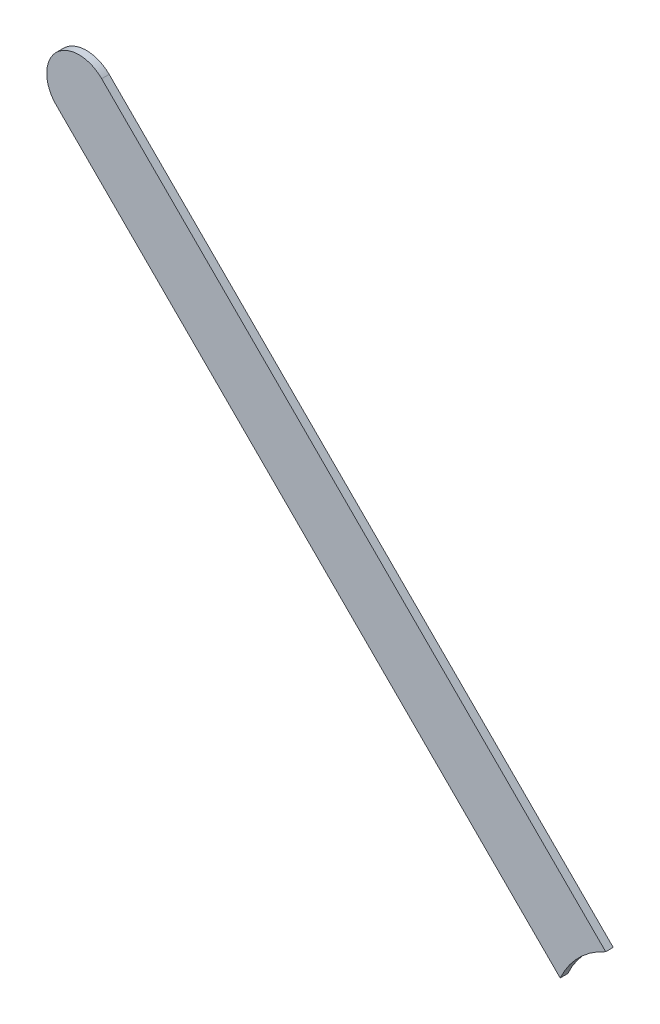
ISO-10303-21;
HEADER;
FILE_DESCRIPTION(('STEP AP214'),'2;1');
FILE_NAME('part.step','',(''),(''),'','','');
FILE_SCHEMA(('AUTOMOTIVE_DESIGN { 1 0 10303 214 1 1 1 1 }'));
ENDSEC;
DATA;
#1=APPLICATION_CONTEXT('core data for automotive mechanical design processes');
#2=APPLICATION_PROTOCOL_DEFINITION('international standard','automotive_design',2000,#1);
#3=PRODUCT_CONTEXT('',#1,'mechanical');
#4=PRODUCT('Part','Part','',(#3));
#5=PRODUCT_RELATED_PRODUCT_CATEGORY('part','',(#4));
#6=PRODUCT_DEFINITION_FORMATION('','',#4);
#7=PRODUCT_DEFINITION_CONTEXT('part definition',#1,'design');
#8=PRODUCT_DEFINITION('design','',#6,#7);
#9=PRODUCT_DEFINITION_SHAPE('','',#8);
#10=(LENGTH_UNIT() NAMED_UNIT(*) SI_UNIT(.MILLI.,.METRE.));
#11=(NAMED_UNIT(*) PLANE_ANGLE_UNIT() SI_UNIT($,.RADIAN.));
#12=(NAMED_UNIT(*) SI_UNIT($,.STERADIAN.) SOLID_ANGLE_UNIT());
#13=UNCERTAINTY_MEASURE_WITH_UNIT(LENGTH_MEASURE(1.E-05),#10,'distance_accuracy_value','');
#14=(GEOMETRIC_REPRESENTATION_CONTEXT(3) GLOBAL_UNCERTAINTY_ASSIGNED_CONTEXT((#13)) GLOBAL_UNIT_ASSIGNED_CONTEXT((#10,
#11,#12)) REPRESENTATION_CONTEXT('',''));
#15=CARTESIAN_POINT('',(0.,0.,0.));
#16=DIRECTION('',(0.,0.,1.));
#17=DIRECTION('',(1.,0.,0.));
#18=AXIS2_PLACEMENT_3D('',#15,#16,#17);
#19=CARTESIAN_POINT('',(167.620933,-68.686066,-0.035));
#20=DIRECTION('',(0.707106781186548,0.707106781186548,0.));
#21=DIRECTION('',(0.,0.,-1.));
#22=AXIS2_PLACEMENT_3D('',#19,#20,#21);
#23=PLANE('',#22);
#24=DIRECTION('',(0.,0.,-1.));
#25=VECTOR('',#24,1.);
#26=CARTESIAN_POINT('',(169.97055313514,-71.03568613514,-0.045));
#27=LINE('',#26,#25);
#28=CARTESIAN_POINT('',(169.97055313514,-71.03568613514,0.));
#29=VERTEX_POINT('',#28);
#30=CARTESIAN_POINT('',(169.97055313514,-71.03568613514,-0.035));
#31=VERTEX_POINT('',#30);
#32=EDGE_CURVE('E11',#29,#31,#27,.T.);
#33=ORIENTED_EDGE('',*,*,#32,.F.);
#34=DIRECTION('',(0.707106781186548,-0.707106781186548,0.));
#35=VECTOR('',#34,1.);
#36=CARTESIAN_POINT('',(167.620933,-68.686066,0.));
#37=LINE('',#36,#35);
#38=CARTESIAN_POINT('',(167.620933,-68.686066,0.));
#39=VERTEX_POINT('',#38);
#40=EDGE_CURVE('E20',#39,#29,#37,.T.);
#41=ORIENTED_EDGE('',*,*,#40,.F.);
#42=DIRECTION('',(0.,0.,1.));
#43=VECTOR('',#42,1.);
#44=CARTESIAN_POINT('',(167.620933,-68.686066,-0.035));
#45=LINE('',#44,#43);
#46=CARTESIAN_POINT('',(167.620933,-68.686066,-0.035));
#47=VERTEX_POINT('',#46);
#48=EDGE_CURVE('E77',#47,#39,#45,.T.);
#49=ORIENTED_EDGE('',*,*,#48,.F.);
#50=DIRECTION('',(0.707106781186548,-0.707106781186548,0.));
#51=VECTOR('',#50,1.);
#52=CARTESIAN_POINT('',(167.620933,-68.686066,-0.035));
#53=LINE('',#52,#51);
#54=EDGE_CURVE('E72',#47,#31,#53,.T.);
#55=ORIENTED_EDGE('',*,*,#54,.T.);
#56=EDGE_LOOP('',(#33,#41,#49,#55));
#57=FACE_BOUND('',#56,.T.);
#58=ADVANCED_FACE('F17',(#57),#23,.F.);
#59=CARTESIAN_POINT('',(170.3578,-71.2108,-0.045));
#60=DIRECTION('',(0.,0.,-1.));
#61=DIRECTION('',(0.,-1.,0.));
#62=AXIS2_PLACEMENT_3D('',#59,#60,#61);
#63=CYLINDRICAL_SURFACE('',#62,0.425);
#64=DIRECTION('',(0.,0.,-1.));
#65=VECTOR('',#64,1.);
#66=CARTESIAN_POINT('',(170.18268613514,-70.82355313514,-0.045));
#67=LINE('',#66,#65);
#68=CARTESIAN_POINT('',(170.18268613514,-70.82355313514,0.));
#69=VERTEX_POINT('',#68);
#70=CARTESIAN_POINT('',(170.18268613514,-70.82355313514,-0.035));
#71=VERTEX_POINT('',#70);
#72=EDGE_CURVE('E90',#69,#71,#67,.T.);
#73=ORIENTED_EDGE('',*,*,#72,.F.);
#74=CARTESIAN_POINT('',(170.3578,-71.2108,0.));
#75=DIRECTION('',(0.,0.,-1.));
#76=DIRECTION('',(0.,-1.,0.));
#77=AXIS2_PLACEMENT_3D('',#74,#75,#76);
#78=CIRCLE('',#77,0.425);
#79=EDGE_CURVE('E67',#29,#69,#78,.T.);
#80=ORIENTED_EDGE('',*,*,#79,.F.);
#81=ORIENTED_EDGE('',*,*,#32,.T.);
#82=CARTESIAN_POINT('',(170.3578,-71.2108,-0.035));
#83=DIRECTION('',(0.,0.,-1.));
#84=DIRECTION('',(0.,-1.,0.));
#85=AXIS2_PLACEMENT_3D('',#82,#83,#84);
#86=CIRCLE('',#85,0.425);
#87=EDGE_CURVE('E65',#31,#71,#86,.T.);
#88=ORIENTED_EDGE('',*,*,#87,.T.);
#89=EDGE_LOOP('',(#73,#80,#81,#88));
#90=FACE_BOUND('',#89,.T.);
#91=ADVANCED_FACE('F64',(#90),#63,.F.);
#92=CARTESIAN_POINT('',(170.463866,-71.104733,0.));
#93=DIRECTION('',(0.,0.,1.));
#94=DIRECTION('',(1.,0.,0.));
#95=AXIS2_PLACEMENT_3D('',#92,#93,#94);
#96=PLANE('',#95);
#97=ORIENTED_EDGE('',*,*,#79,.T.);
#98=DIRECTION('',(-0.707106781186548,0.707106781186548,0.));
#99=VECTOR('',#98,1.);
#100=CARTESIAN_POINT('',(170.463866,-71.104733,0.));
#101=LINE('',#100,#99);
#102=CARTESIAN_POINT('',(167.833066,-68.473933,0.));
#103=VERTEX_POINT('',#102);
#104=EDGE_CURVE('E106',#69,#103,#101,.T.);
#105=ORIENTED_EDGE('',*,*,#104,.T.);
#106=CARTESIAN_POINT('',(167.7269995,-68.5799995,0.));
#107=DIRECTION('',(0.,0.,1.));
#108=DIRECTION('',(0.707106781186548,0.707106781186548,0.));
#109=AXIS2_PLACEMENT_3D('',#106,#107,#108);
#110=CIRCLE('',#109,0.150000682813);
#111=EDGE_CURVE('E95',#103,#39,#110,.T.);
#112=ORIENTED_EDGE('',*,*,#111,.T.);
#113=ORIENTED_EDGE('',*,*,#40,.T.);
#114=EDGE_LOOP('',(#97,#105,#112,#113));
#115=FACE_BOUND('',#114,.T.);
#116=ADVANCED_FACE('F104',(#115),#96,.T.);
#117=CARTESIAN_POINT('',(167.7269995,-68.5799995,-0.035));
#118=DIRECTION('',(0.,0.,-1.));
#119=DIRECTION('',(0.707106781186548,0.707106781186548,0.));
#120=AXIS2_PLACEMENT_3D('',#117,#118,#119);
#121=CYLINDRICAL_SURFACE('',#120,0.150000682813);
#122=CARTESIAN_POINT('',(167.7269995,-68.5799995,-0.035));
#123=DIRECTION('',(0.,0.,1.));
#124=DIRECTION('',(0.707106781186548,0.707106781186548,0.));
#125=AXIS2_PLACEMENT_3D('',#122,#123,#124);
#126=CIRCLE('',#125,0.150000682813);
#127=CARTESIAN_POINT('',(167.833066,-68.473933,-0.035));
#128=VERTEX_POINT('',#127);
#129=EDGE_CURVE('E78',#128,#47,#126,.T.);
#130=ORIENTED_EDGE('',*,*,#129,.T.);
#131=ORIENTED_EDGE('',*,*,#48,.T.);
#132=ORIENTED_EDGE('',*,*,#111,.F.);
#133=DIRECTION('',(0.,0.,1.));
#134=VECTOR('',#133,1.);
#135=CARTESIAN_POINT('',(167.833066,-68.473933,-0.035));
#136=LINE('',#135,#134);
#137=EDGE_CURVE('E111',#128,#103,#136,.T.);
#138=ORIENTED_EDGE('',*,*,#137,.F.);
#139=EDGE_LOOP('',(#130,#131,#132,#138));
#140=FACE_BOUND('',#139,.T.);
#141=ADVANCED_FACE('F110',(#140),#121,.T.);
#142=CARTESIAN_POINT('',(170.463866,-71.104733,-0.035));
#143=DIRECTION('',(0.,0.,1.));
#144=DIRECTION('',(1.,0.,0.));
#145=AXIS2_PLACEMENT_3D('',#142,#143,#144);
#146=PLANE('',#145);
#147=ORIENTED_EDGE('',*,*,#54,.F.);
#148=ORIENTED_EDGE('',*,*,#129,.F.);
#149=DIRECTION('',(-0.707106781186548,0.707106781186548,0.));
#150=VECTOR('',#149,1.);
#151=CARTESIAN_POINT('',(170.463866,-71.104733,-0.035));
#152=LINE('',#151,#150);
#153=EDGE_CURVE('E74',#71,#128,#152,.T.);
#154=ORIENTED_EDGE('',*,*,#153,.F.);
#155=ORIENTED_EDGE('',*,*,#87,.F.);
#156=EDGE_LOOP('',(#147,#148,#154,#155));
#157=FACE_BOUND('',#156,.T.);
#158=ADVANCED_FACE('F70',(#157),#146,.F.);
#159=CARTESIAN_POINT('',(170.463866,-71.104733,-0.035));
#160=DIRECTION('',(-0.707106781186548,-0.707106781186548,0.));
#161=DIRECTION('',(-0.707106781186548,0.707106781186548,0.));
#162=AXIS2_PLACEMENT_3D('',#159,#160,#161);
#163=PLANE('',#162);
#164=ORIENTED_EDGE('',*,*,#137,.T.);
#165=ORIENTED_EDGE('',*,*,#104,.F.);
#166=ORIENTED_EDGE('',*,*,#72,.T.);
#167=ORIENTED_EDGE('',*,*,#153,.T.);
#168=EDGE_LOOP('',(#164,#165,#166,#167));
#169=FACE_BOUND('',#168,.T.);
#170=ADVANCED_FACE('F113',(#169),#163,.F.);
#171=CLOSED_SHELL('',(#58,#91,#116,#141,#158,#170));
#172=MANIFOLD_SOLID_BREP('B1',#171);
#173=ADVANCED_BREP_SHAPE_REPRESENTATION('',(#18,#172),#14);
#174=SHAPE_DEFINITION_REPRESENTATION(#9,#173);
ENDSEC;
END-ISO-10303-21;
